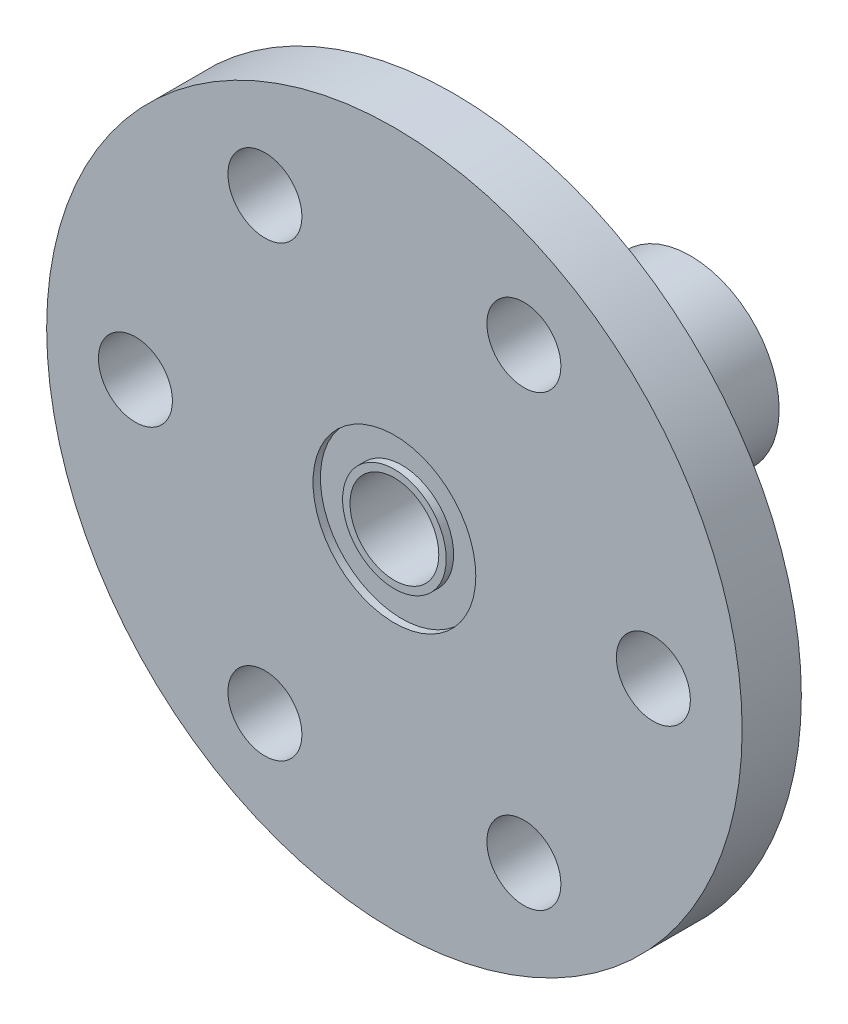
ISO-10303-21;
HEADER;
FILE_DESCRIPTION(('STEP AP214'),'2;1');
FILE_NAME('part.step','',(''),(''),'','','');
FILE_SCHEMA(('AUTOMOTIVE_DESIGN { 1 0 10303 214 1 1 1 1 }'));
ENDSEC;
DATA;
#1=APPLICATION_CONTEXT('core data for automotive mechanical design processes');
#2=APPLICATION_PROTOCOL_DEFINITION('international standard','automotive_design',2000,#1);
#3=PRODUCT_CONTEXT('',#1,'mechanical');
#4=PRODUCT('Part','Part','',(#3));
#5=PRODUCT_RELATED_PRODUCT_CATEGORY('part','',(#4));
#6=PRODUCT_DEFINITION_FORMATION('','',#4);
#7=PRODUCT_DEFINITION_CONTEXT('part definition',#1,'design');
#8=PRODUCT_DEFINITION('design','',#6,#7);
#9=PRODUCT_DEFINITION_SHAPE('','',#8);
#10=(LENGTH_UNIT() NAMED_UNIT(*) SI_UNIT(.MILLI.,.METRE.));
#11=(NAMED_UNIT(*) PLANE_ANGLE_UNIT() SI_UNIT($,.RADIAN.));
#12=(NAMED_UNIT(*) SI_UNIT($,.STERADIAN.) SOLID_ANGLE_UNIT());
#13=UNCERTAINTY_MEASURE_WITH_UNIT(LENGTH_MEASURE(1.E-05),#10,'distance_accuracy_value','');
#14=(GEOMETRIC_REPRESENTATION_CONTEXT(3) GLOBAL_UNCERTAINTY_ASSIGNED_CONTEXT((#13)) GLOBAL_UNIT_ASSIGNED_CONTEXT((#10,
#11,#12)) REPRESENTATION_CONTEXT('',''));
#15=CARTESIAN_POINT('',(0.,0.,0.));
#16=DIRECTION('',(0.,0.,1.));
#17=DIRECTION('',(1.,0.,0.));
#18=AXIS2_PLACEMENT_3D('',#15,#16,#17);
#19=CARTESIAN_POINT('',(0.,0.,4.));
#20=DIRECTION('',(0.,0.,-1.));
#21=DIRECTION('',(-1.,0.,0.));
#22=AXIS2_PLACEMENT_3D('',#19,#20,#21);
#23=CYLINDRICAL_SURFACE('',#22,3.);
#24=CARTESIAN_POINT('',(0.,-3.,-10.));
#25=CARTESIAN_POINT('',(0.100484716668078,-3.0000004164484,-10.0000005496325));
#26=CARTESIAN_POINT('',(0.200969087132901,-2.99490802753388,-9.9923860300445));
#27=CARTESIAN_POINT('',(0.398733058031681,-2.97504652423809,-9.96240313589434));
#28=CARTESIAN_POINT('',(0.496011113955007,-2.96027281581235,-9.94002775687671));
#29=CARTESIAN_POINT('',(0.684212307854249,-2.92250482404708,-9.88189228267516));
#30=CARTESIAN_POINT('',(0.775162872657554,-2.89954905493315,-9.84619485999206));
#31=CARTESIAN_POINT('',(0.94941529099726,-2.8472613787744,-9.7629366367285));
#32=CARTESIAN_POINT('',(1.03271603160967,-2.8179285460551,-9.71537411369944));
#33=CARTESIAN_POINT('',(1.19728470077011,-2.75227329369838,-9.60534306263257));
#34=CARTESIAN_POINT('',(1.27778030546067,-2.71556897579319,-9.54195213925711));
#35=CARTESIAN_POINT('',(1.42772804469274,-2.63982313083466,-9.40426995134155));
#36=CARTESIAN_POINT('',(1.49716405543888,-2.60077830356832,-9.32996307016226));
#37=CARTESIAN_POINT('',(1.63422297745496,-2.51728264678794,-9.15894763238733));
#38=CARTESIAN_POINT('',(1.6998318636275,-2.47295067937795,-9.06055434679655));
#39=CARTESIAN_POINT('',(1.81350357014175,-2.3908414735282,-8.85163662235347));
#40=CARTESIAN_POINT('',(1.86159673426503,-2.35305295954668,-8.74113359843726));
#41=CARTESIAN_POINT('',(1.92674035011438,-2.29976266641461,-8.54328870657837));
#42=CARTESIAN_POINT('',(1.94874447236008,-2.28097627892403,-8.45847154712609));
#43=CARTESIAN_POINT('',(1.98150617785228,-2.25257969659604,-8.28525549525835));
#44=CARTESIAN_POINT('',(1.99228314651963,-2.24295368744147,-8.19686305127394));
#45=CARTESIAN_POINT('',(2.00191364141227,-2.23436605608045,-8.01852522114353));
#46=CARTESIAN_POINT('',(2.00071842917524,-2.23544802558502,-7.9285749765476));
#47=CARTESIAN_POINT('',(1.98637581333356,-2.24819775483425,-7.75036502650024));
#48=CARTESIAN_POINT('',(1.97321828380393,-2.25987448286881,-7.66210681797187));
#49=CARTESIAN_POINT('',(1.93664994217326,-2.2912718598996,-7.49353294875812));
#50=CARTESIAN_POINT('',(1.91371711479477,-2.31061488324375,-7.41303866406123));
#51=CARTESIAN_POINT('',(1.85870118583424,-2.35509622933623,-7.25697630902422));
#52=CARTESIAN_POINT('',(1.8266150732855,-2.3802364585489,-7.18140986976135));
#53=CARTESIAN_POINT('',(1.74673818732648,-2.43964196377947,-7.02097460464356));
#54=CARTESIAN_POINT('',(1.69708052300445,-2.47472317740626,-6.9373400995169));
#55=CARTESIAN_POINT('',(1.58668960438221,-2.54691537733438,-6.77861660471425));
#56=CARTESIAN_POINT('',(1.52594268999614,-2.58402882709328,-6.70353834223793));
#57=CARTESIAN_POINT('',(1.37981165322308,-2.66543343763724,-6.54745745439658));
#58=CARTESIAN_POINT('',(1.29193938283656,-2.7095474472056,-6.46866595131724));
#59=CARTESIAN_POINT('',(1.10200799908008,-2.79218100665212,-6.32680350546151));
#60=CARTESIAN_POINT('',(0.999962299343694,-2.83070577648042,-6.26371785459102));
#61=CARTESIAN_POINT('',(0.804857827096527,-2.89145404090364,-6.16652228137713));
#62=CARTESIAN_POINT('',(0.713957643371907,-2.9153926116554,-6.12915663666106));
#63=CARTESIAN_POINT('',(0.526036043935477,-2.95507719030499,-6.06789507437463));
#64=CARTESIAN_POINT('',(0.429019879001647,-2.97083012127544,-6.04398777286778));
#65=CARTESIAN_POINT('',(0.230985453172278,-2.99275882156808,-6.010838834762));
#66=CARTESIAN_POINT('',(0.129951811934155,-2.99889322461187,-6.00166053906174));
#67=CARTESIAN_POINT('',(-0.0724415193893495,-3.00083114965147,-5.99875291143779));
#68=CARTESIAN_POINT('',(-0.173801186186628,-2.99663539385634,-6.00502249951123));
#69=CARTESIAN_POINT('',(-0.366455717204242,-2.97899589424273,-6.03162405556195));
#70=CARTESIAN_POINT('',(-0.457957444679196,-2.96622246390226,-6.05093729775522));
#71=CARTESIAN_POINT('',(-0.636116392427403,-2.93318449284837,-6.10159568601286));
#72=CARTESIAN_POINT('',(-0.722772837571136,-2.91291875746989,-6.13294275092821));
#73=CARTESIAN_POINT('',(-0.894664750465999,-2.86496352529158,-6.20865229704492));
#74=CARTESIAN_POINT('',(-0.979496184631422,-2.83689870135785,-6.25368815408186));
#75=CARTESIAN_POINT('',(-1.14068302395729,-2.7760185561151,-6.35443328994628));
#76=CARTESIAN_POINT('',(-1.21703314820091,-2.74320030403941,-6.41014916053217));
#77=CARTESIAN_POINT('',(-1.37185445482324,-2.6695454665343,-6.54060786815751));
#78=CARTESIAN_POINT('',(-1.44875187569565,-2.62826156800165,-6.61696626007509));
#79=CARTESIAN_POINT('',(-1.58933968069449,-2.54571173085957,-6.78111142995712));
#80=CARTESIAN_POINT('',(-1.6530209365723,-2.50444582417845,-6.86890603910751));
#81=CARTESIAN_POINT('',(-1.76124776549313,-2.4293967897058,-7.04714241276813));
#82=CARTESIAN_POINT('',(-1.80695636125283,-2.39527597025701,-7.13673203346221));
#83=CARTESIAN_POINT('',(-1.88496213740264,-2.33438974266154,-7.32387265244364));
#84=CARTESIAN_POINT('',(-1.91728345682189,-2.30761112529822,-7.42140893830463));
#85=CARTESIAN_POINT('',(-1.9623584346534,-2.26933208182633,-7.60456448719542));
#86=CARTESIAN_POINT('',(-1.97758597566225,-2.25594998021257,-7.68917180987601));
#87=CARTESIAN_POINT('',(-1.99699205923373,-2.23879466438398,-7.86057328131839));
#88=CARTESIAN_POINT('',(-2.00118260285317,-2.23501101347816,-7.9473649511395));
#89=CARTESIAN_POINT('',(-1.99823921981266,-2.23764201149981,-8.1206430567237));
#90=CARTESIAN_POINT('',(-1.99109858767783,-2.24406269907463,-8.20712928137376));
#91=CARTESIAN_POINT('',(-1.96596997224746,-2.26610452403491,-8.37734352853212));
#92=CARTESIAN_POINT('',(-1.94796751728258,-2.28173793527615,-8.46106771382433));
#93=CARTESIAN_POINT('',(-1.89593035657494,-2.32526843904801,-8.64571118648124));
#94=CARTESIAN_POINT('',(-1.85890187130765,-2.35532333574983,-8.74526771294333));
#95=CARTESIAN_POINT('',(-1.7708452623622,-2.42222161121309,-8.93548683438421));
#96=CARTESIAN_POINT('',(-1.71979748341259,-2.459074496867,-9.02613669799169));
#97=CARTESIAN_POINT('',(-1.60398280555153,-2.53617186577119,-9.19928188713623));
#98=CARTESIAN_POINT('',(-1.53898309894021,-2.5764658739228,-9.28159874542305));
#99=CARTESIAN_POINT('',(-1.39671768031094,-2.65628301537844,-9.43532247825793));
#100=CARTESIAN_POINT('',(-1.31944821025748,-2.69580590832396,-9.50672599702921));
#101=CARTESIAN_POINT('',(-1.14145732976974,-2.77631551964082,-9.64671210430908));
#102=CARTESIAN_POINT('',(-1.03896166955575,-2.81669805449991,-9.71341864017832));
#103=CARTESIAN_POINT('',(-0.820868555771217,-2.88777665874161,-9.8279132766653));
#104=CARTESIAN_POINT('',(-0.705292062449156,-2.91848793445255,-9.87573110682395));
#105=CARTESIAN_POINT('',(-0.491435069835745,-2.96101644836895,-9.94115457816378));
#106=CARTESIAN_POINT('',(-0.395012325257921,-2.97551480368935,-9.96311103909862));
#107=CARTESIAN_POINT('',(-0.199058012023946,-2.99500280141853,-9.9925280325381));
#108=CARTESIAN_POINT('',(-0.0995288361880077,-2.99999958751315,-9.99999945559601));
#109=CARTESIAN_POINT('',(0.,-3.,-10.));
#110=B_SPLINE_CURVE_WITH_KNOTS('',3,(#24,#25,#26,#27,#28,#29,#30,#31,#32,#33,#34,#35,#36,#37,
#38,#39,#40,#41,#42,#43,#44,#45,#46,#47,#48,#49,#50,#51,#52,#53,#54,#55,#56,#57,#58,#59,#60,#61,
#62,#63,#64,#65,#66,#67,#68,#69,#70,#71,#72,#73,#74,#75,#76,#77,#78,#79,#80,#81,#82,#83,#84,#85,
#86,#87,#88,#89,#90,#91,#92,#93,#94,#95,#96,#97,#98,#99,#100,#101,#102,#103,#104,#105,#106,#107,
#108,#109),.UNSPECIFIED.,.T.,.F.,(4,2,2,2,2,2,2,2,2,2,2,2,2,2,2,2,2,2,2,2,2,2,2,2,2,2,2,2,2,2,2,
2,2,2,2,2,2,2,2,2,2,2,4),(0.,0.3010532265054,0.602249414348688,0.902046153190231,
1.20188643867387,1.52717029000557,1.85292411604319,2.23006683295982,2.60655305445439,
2.87433693676029,3.14165767845809,3.41006711735378,3.67870397263352,3.93548862198022,
4.19235783805079,4.50147574660874,4.81097703780057,5.18718954496752,5.56304840301363,
5.86524087696758,6.16717735142814,6.47040883294251,6.77361911533415,7.05553084792473,
7.33748755138271,7.63652346829516,7.93574454945204,8.28228176141292,8.62905753175758,
8.94649935304476,9.26336626640723,9.52324048016135,9.78283200333091,10.0425772028455,
10.302669238524,10.6320660870419,10.9619271337795,11.2977924520448,11.6337608397015,
12.0179535155883,12.4015390656082,12.6999529136674,12.9981423125957),.UNSPECIFIED.);
#111=CARTESIAN_POINT('',(0.,-3.,-10.));
#112=VERTEX_POINT('',#111);
#113=EDGE_CURVE('E75',#112,#112,#110,.T.);
#114=ORIENTED_EDGE('',*,*,#113,.T.);
#115=EDGE_LOOP('',(#114));
#116=FACE_BOUND('',#115,.T.);
#117=CARTESIAN_POINT('',(0.,0.,4.));
#118=DIRECTION('',(0.,0.,1.));
#119=DIRECTION('',(1.,0.,0.));
#120=AXIS2_PLACEMENT_3D('',#117,#118,#119);
#121=CIRCLE('',#120,3.);
#122=CARTESIAN_POINT('',(3.,0.,4.));
#123=VERTEX_POINT('',#122);
#124=EDGE_CURVE('E130',#123,#123,#121,.T.);
#125=ORIENTED_EDGE('',*,*,#124,.T.);
#126=EDGE_LOOP('',(#125));
#127=FACE_BOUND('',#126,.T.);
#128=CARTESIAN_POINT('',(0.,0.,-16.));
#129=DIRECTION('',(0.,0.,-1.));
#130=DIRECTION('',(-1.,0.,0.));
#131=AXIS2_PLACEMENT_3D('',#128,#129,#130);
#132=CIRCLE('',#131,3.);
#133=CARTESIAN_POINT('',(-3.,0.,-16.));
#134=VERTEX_POINT('',#133);
#135=EDGE_CURVE('E137',#134,#134,#132,.T.);
#136=ORIENTED_EDGE('',*,*,#135,.T.);
#137=EDGE_LOOP('',(#136));
#138=FACE_BOUND('',#137,.T.);
#139=CARTESIAN_POINT('',(0.,3.,-10.));
#140=CARTESIAN_POINT('',(-0.100484716668078,3.0000004164484,-10.0000005496325));
#141=CARTESIAN_POINT('',(-0.200969087132901,2.99490802753388,-9.9923860300445));
#142=CARTESIAN_POINT('',(-0.398733058031681,2.97504652423809,-9.96240313589434));
#143=CARTESIAN_POINT('',(-0.496011113955007,2.96027281581235,-9.94002775687671));
#144=CARTESIAN_POINT('',(-0.684212307854249,2.92250482404708,-9.88189228267516));
#145=CARTESIAN_POINT('',(-0.775162872657554,2.89954905493315,-9.84619485999206));
#146=CARTESIAN_POINT('',(-0.94941529099726,2.8472613787744,-9.7629366367285));
#147=CARTESIAN_POINT('',(-1.03271603160967,2.8179285460551,-9.71537411369944));
#148=CARTESIAN_POINT('',(-1.19728470077011,2.75227329369838,-9.60534306263257));
#149=CARTESIAN_POINT('',(-1.27778030546067,2.71556897579319,-9.54195213925711));
#150=CARTESIAN_POINT('',(-1.42772804469274,2.63982313083466,-9.40426995134155));
#151=CARTESIAN_POINT('',(-1.49716405543888,2.60077830356832,-9.32996307016226));
#152=CARTESIAN_POINT('',(-1.63422297745496,2.51728264678794,-9.15894763238733));
#153=CARTESIAN_POINT('',(-1.6998318636275,2.47295067937795,-9.06055434679655));
#154=CARTESIAN_POINT('',(-1.81350357014175,2.3908414735282,-8.85163662235347));
#155=CARTESIAN_POINT('',(-1.86159673426503,2.35305295954668,-8.74113359843726));
#156=CARTESIAN_POINT('',(-1.92674035011438,2.29976266641461,-8.54328870657837));
#157=CARTESIAN_POINT('',(-1.94874447236008,2.28097627892403,-8.45847154712609));
#158=CARTESIAN_POINT('',(-1.98150617785228,2.25257969659604,-8.28525549525835));
#159=CARTESIAN_POINT('',(-1.99228314651963,2.24295368744147,-8.19686305127394));
#160=CARTESIAN_POINT('',(-2.00191364141227,2.23436605608045,-8.01852522114353));
#161=CARTESIAN_POINT('',(-2.00071842917524,2.23544802558502,-7.9285749765476));
#162=CARTESIAN_POINT('',(-1.98637581333356,2.24819775483425,-7.75036502650024));
#163=CARTESIAN_POINT('',(-1.97321828380393,2.25987448286881,-7.66210681797187));
#164=CARTESIAN_POINT('',(-1.93664994217326,2.2912718598996,-7.49353294875812));
#165=CARTESIAN_POINT('',(-1.91371711479477,2.31061488324375,-7.41303866406123));
#166=CARTESIAN_POINT('',(-1.85870118583424,2.35509622933623,-7.25697630902422));
#167=CARTESIAN_POINT('',(-1.8266150732855,2.3802364585489,-7.18140986976135));
#168=CARTESIAN_POINT('',(-1.74673818732648,2.43964196377947,-7.02097460464356));
#169=CARTESIAN_POINT('',(-1.69708052300445,2.47472317740626,-6.9373400995169));
#170=CARTESIAN_POINT('',(-1.58668960438221,2.54691537733438,-6.77861660471425));
#171=CARTESIAN_POINT('',(-1.52594268999614,2.58402882709328,-6.70353834223793));
#172=CARTESIAN_POINT('',(-1.37981165322308,2.66543343763724,-6.54745745439658));
#173=CARTESIAN_POINT('',(-1.29193938283656,2.7095474472056,-6.46866595131724));
#174=CARTESIAN_POINT('',(-1.10200799908008,2.79218100665212,-6.32680350546151));
#175=CARTESIAN_POINT('',(-0.999962299343694,2.83070577648042,-6.26371785459102));
#176=CARTESIAN_POINT('',(-0.804857827096527,2.89145404090364,-6.16652228137713));
#177=CARTESIAN_POINT('',(-0.713957643371907,2.9153926116554,-6.12915663666106));
#178=CARTESIAN_POINT('',(-0.526036043935477,2.95507719030499,-6.06789507437463));
#179=CARTESIAN_POINT('',(-0.429019879001647,2.97083012127544,-6.04398777286778));
#180=CARTESIAN_POINT('',(-0.230985453172278,2.99275882156808,-6.010838834762));
#181=CARTESIAN_POINT('',(-0.129951811934155,2.99889322461187,-6.00166053906174));
#182=CARTESIAN_POINT('',(0.0724415193893495,3.00083114965147,-5.99875291143779));
#183=CARTESIAN_POINT('',(0.173801186186628,2.99663539385634,-6.00502249951123));
#184=CARTESIAN_POINT('',(0.366455717204242,2.97899589424273,-6.03162405556195));
#185=CARTESIAN_POINT('',(0.457957444679196,2.96622246390226,-6.05093729775522));
#186=CARTESIAN_POINT('',(0.636116392427403,2.93318449284837,-6.10159568601286));
#187=CARTESIAN_POINT('',(0.722772837571136,2.91291875746989,-6.13294275092821));
#188=CARTESIAN_POINT('',(0.894664750465999,2.86496352529158,-6.20865229704492));
#189=CARTESIAN_POINT('',(0.979496184631422,2.83689870135785,-6.25368815408186));
#190=CARTESIAN_POINT('',(1.14068302395729,2.7760185561151,-6.35443328994628));
#191=CARTESIAN_POINT('',(1.21703314820091,2.74320030403941,-6.41014916053217));
#192=CARTESIAN_POINT('',(1.37185445482324,2.6695454665343,-6.54060786815751));
#193=CARTESIAN_POINT('',(1.44875187569565,2.62826156800165,-6.61696626007509));
#194=CARTESIAN_POINT('',(1.58933968069449,2.54571173085957,-6.78111142995712));
#195=CARTESIAN_POINT('',(1.6530209365723,2.50444582417845,-6.86890603910751));
#196=CARTESIAN_POINT('',(1.76124776549313,2.4293967897058,-7.04714241276813));
#197=CARTESIAN_POINT('',(1.80695636125283,2.39527597025701,-7.13673203346221));
#198=CARTESIAN_POINT('',(1.88496213740264,2.33438974266154,-7.32387265244364));
#199=CARTESIAN_POINT('',(1.91728345682189,2.30761112529822,-7.42140893830463));
#200=CARTESIAN_POINT('',(1.9623584346534,2.26933208182633,-7.60456448719542));
#201=CARTESIAN_POINT('',(1.97758597566225,2.25594998021257,-7.68917180987601));
#202=CARTESIAN_POINT('',(1.99699205923373,2.23879466438398,-7.86057328131839));
#203=CARTESIAN_POINT('',(2.00118260285317,2.23501101347816,-7.9473649511395));
#204=CARTESIAN_POINT('',(1.99823921981266,2.23764201149981,-8.1206430567237));
#205=CARTESIAN_POINT('',(1.99109858767783,2.24406269907463,-8.20712928137376));
#206=CARTESIAN_POINT('',(1.96596997224746,2.26610452403491,-8.37734352853212));
#207=CARTESIAN_POINT('',(1.94796751728258,2.28173793527615,-8.46106771382433));
#208=CARTESIAN_POINT('',(1.89593035657494,2.32526843904801,-8.64571118648124));
#209=CARTESIAN_POINT('',(1.85890187130765,2.35532333574983,-8.74526771294333));
#210=CARTESIAN_POINT('',(1.7708452623622,2.42222161121309,-8.93548683438421));
#211=CARTESIAN_POINT('',(1.71979748341259,2.459074496867,-9.02613669799169));
#212=CARTESIAN_POINT('',(1.60398280555153,2.53617186577119,-9.19928188713623));
#213=CARTESIAN_POINT('',(1.53898309894021,2.5764658739228,-9.28159874542305));
#214=CARTESIAN_POINT('',(1.39671768031094,2.65628301537844,-9.43532247825793));
#215=CARTESIAN_POINT('',(1.31944821025748,2.69580590832396,-9.50672599702921));
#216=CARTESIAN_POINT('',(1.14145732976974,2.77631551964082,-9.64671210430908));
#217=CARTESIAN_POINT('',(1.03896166955575,2.81669805449991,-9.71341864017832));
#218=CARTESIAN_POINT('',(0.820868555771217,2.88777665874161,-9.8279132766653));
#219=CARTESIAN_POINT('',(0.705292062449156,2.91848793445255,-9.87573110682395));
#220=CARTESIAN_POINT('',(0.491435069835745,2.96101644836895,-9.94115457816378));
#221=CARTESIAN_POINT('',(0.395012325257921,2.97551480368935,-9.96311103909862));
#222=CARTESIAN_POINT('',(0.199058012023946,2.99500280141853,-9.9925280325381));
#223=CARTESIAN_POINT('',(0.0995288361880077,2.99999958751315,-9.99999945559601));
#224=CARTESIAN_POINT('',(0.,3.,-10.));
#225=B_SPLINE_CURVE_WITH_KNOTS('',3,(#139,#140,#141,#142,#143,#144,#145,#146,#147,#148,#149,
#150,#151,#152,#153,#154,#155,#156,#157,#158,#159,#160,#161,#162,#163,#164,#165,#166,#167,#168,
#169,#170,#171,#172,#173,#174,#175,#176,#177,#178,#179,#180,#181,#182,#183,#184,#185,#186,#187,
#188,#189,#190,#191,#192,#193,#194,#195,#196,#197,#198,#199,#200,#201,#202,#203,#204,#205,#206,
#207,#208,#209,#210,#211,#212,#213,#214,#215,#216,#217,#218,#219,#220,#221,#222,#223,#224),
.UNSPECIFIED.,.T.,.F.,(4,2,2,2,2,2,2,2,2,2,2,2,2,2,2,2,2,2,2,2,2,2,2,2,2,2,2,2,2,2,2,2,2,2,2,2,
2,2,2,2,2,2,4),(0.,0.3010532265054,0.602249414348688,0.902046153190231,1.20188643867387,
1.52717029000557,1.85292411604319,2.23006683295982,2.60655305445439,2.87433693676029,
3.14165767845809,3.41006711735378,3.67870397263352,3.93548862198022,4.19235783805079,
4.50147574660874,4.81097703780057,5.18718954496752,5.56304840301363,5.86524087696758,
6.16717735142814,6.47040883294251,6.77361911533415,7.05553084792473,7.33748755138271,
7.63652346829516,7.93574454945204,8.28228176141292,8.62905753175758,8.94649935304476,
9.26336626640723,9.52324048016135,9.78283200333091,10.0425772028455,10.302669238524,
10.6320660870419,10.9619271337795,11.2977924520448,11.6337608397015,12.0179535155883,
12.4015390656082,12.6999529136674,12.9981423125957),.UNSPECIFIED.);
#226=CARTESIAN_POINT('',(0.,3.,-10.));
#227=VERTEX_POINT('',#226);
#228=EDGE_CURVE('E80',#227,#227,#225,.T.);
#229=ORIENTED_EDGE('',*,*,#228,.T.);
#230=EDGE_LOOP('',(#229));
#231=FACE_BOUND('',#230,.T.);
#232=ADVANCED_FACE('F32',(#116,#127,#138,#231),#23,.F.);
#233=CARTESIAN_POINT('',(0.,0.,-16.));
#234=DIRECTION('',(0.,0.,1.));
#235=DIRECTION('',(1.,0.,0.));
#236=AXIS2_PLACEMENT_3D('',#233,#234,#235);
#237=CYLINDRICAL_SURFACE('',#236,6.);
#238=CARTESIAN_POINT('',(0.,0.,-16.));
#239=DIRECTION('',(0.,0.,-1.));
#240=DIRECTION('',(-1.,0.,0.));
#241=AXIS2_PLACEMENT_3D('',#238,#239,#240);
#242=CIRCLE('',#241,6.);
#243=CARTESIAN_POINT('',(-6.,0.,-16.));
#244=VERTEX_POINT('',#243);
#245=EDGE_CURVE('E132',#244,#244,#242,.T.);
#246=ORIENTED_EDGE('',*,*,#245,.F.);
#247=EDGE_LOOP('',(#246));
#248=FACE_BOUND('',#247,.T.);
#249=CARTESIAN_POINT('',(0.,0.,0.));
#250=DIRECTION('',(0.,0.,1.));
#251=DIRECTION('',(1.,0.,0.));
#252=AXIS2_PLACEMENT_3D('',#249,#250,#251);
#253=CIRCLE('',#252,6.);
#254=CARTESIAN_POINT('',(6.,0.,0.));
#255=VERTEX_POINT('',#254);
#256=EDGE_CURVE('E10',#255,#255,#253,.F.);
#257=ORIENTED_EDGE('',*,*,#256,.T.);
#258=EDGE_LOOP('',(#257));
#259=FACE_BOUND('',#258,.T.);
#260=CARTESIAN_POINT('',(0.,-6.,-10.));
#261=CARTESIAN_POINT('',(0.109126725773446,-6.00000030601888,-10.0000005074633));
#262=CARTESIAN_POINT('',(0.2182503890771,-5.9969953901509,-9.99103946774557));
#263=CARTESIAN_POINT('',(0.433283521745945,-5.98530420406562,-9.95554178236556));
#264=CARTESIAN_POINT('',(0.539192656237636,-5.97661734404305,-9.92900331210216));
#265=CARTESIAN_POINT('',(0.744665579003552,-5.95450615812885,-9.8593615132319));
#266=CARTESIAN_POINT('',(0.844239651772068,-5.94108975461707,-9.81628587508146));
#267=CARTESIAN_POINT('',(1.03474987361065,-5.91088891434684,-9.71491765432331));
#268=CARTESIAN_POINT('',(1.12568431391741,-5.89410381335556,-9.6566220699948));
#269=CARTESIAN_POINT('',(1.29948335004453,-5.8582818888601,-9.52434839028249));
#270=CARTESIAN_POINT('',(1.38200740059662,-5.8391911292757,-9.44993753147901));
#271=CARTESIAN_POINT('',(1.53366538540417,-5.80120629566243,-9.28846569058687));
#272=CARTESIAN_POINT('',(1.60279637097892,-5.78231226581098,-9.20140193014298));
#273=CARTESIAN_POINT('',(1.72764988445572,-5.74626664954548,-9.01402976960708));
#274=CARTESIAN_POINT('',(1.78292971644206,-5.72918078551376,-8.91341252053576));
#275=CARTESIAN_POINT('',(1.87563774775544,-5.69950610837202,-8.70364781108291));
#276=CARTESIAN_POINT('',(1.91307139477353,-5.68691592321491,-8.59450296567451));
#277=CARTESIAN_POINT('',(1.96774692301833,-5.66822606538755,-8.37465355700658));
#278=CARTESIAN_POINT('',(1.98562689654354,-5.66192191539223,-8.26412558302187));
#279=CARTESIAN_POINT('',(2.00268224666895,-5.65591313259015,-8.04147249168824));
#280=CARTESIAN_POINT('',(2.00186340320944,-5.6562064604546,-7.92934787858162));
#281=CARTESIAN_POINT('',(1.98203980740684,-5.6631803001636,-7.71212673911196));
#282=CARTESIAN_POINT('',(1.96386782633399,-5.66956831735066,-7.60694319416196));
#283=CARTESIAN_POINT('',(1.91121232569883,-5.68753315449102,-7.40121316078633));
#284=CARTESIAN_POINT('',(1.87672685318374,-5.69911059568215,-7.30066722912986));
#285=CARTESIAN_POINT('',(1.79187811612042,-5.72635822262498,-7.10517450081704));
#286=CARTESIAN_POINT('',(1.74126809741453,-5.74209131586235,-7.01034394906095));
#287=CARTESIAN_POINT('',(1.62577821260628,-5.77585117151453,-6.83025818344055));
#288=CARTESIAN_POINT('',(1.56089422472801,-5.79387859580927,-6.74500574613324));
#289=CARTESIAN_POINT('',(1.41469866536448,-5.83134658335482,-6.58181680367846));
#290=CARTESIAN_POINT('',(1.33270630015262,-5.85081178709686,-6.50449461098186));
#291=CARTESIAN_POINT('',(1.15667913994013,-5.88813876774073,-6.36453746667321));
#292=CARTESIAN_POINT('',(1.06264319132163,-5.90600039076135,-6.30190392367101));
#293=CARTESIAN_POINT('',(0.863895226092536,-5.93834215875587,-6.19260739952986));
#294=CARTESIAN_POINT('',(0.759086552832674,-5.95278700016078,-6.14610901731854));
#295=CARTESIAN_POINT('',(0.542538166729016,-5.9764113428887,-6.07159365208858));
#296=CARTESIAN_POINT('',(0.430800876309908,-5.98559267309759,-6.04357024915312));
#297=CARTESIAN_POINT('',(0.208767659058609,-5.99735254142881,-6.00788866795528));
#298=CARTESIAN_POINT('',(0.0986191997296935,-6.00020003667456,-5.9994003816545));
#299=CARTESIAN_POINT('',(-0.121550139920474,-5.99977805389655,-6.00066534719694));
#300=CARTESIAN_POINT('',(-0.2315710386393,-5.99650960838725,-6.01041551995975));
#301=CARTESIAN_POINT('',(-0.44503973260851,-5.98440049434209,-6.04722381547192));
#302=CARTESIAN_POINT('',(-0.548585613669686,-5.97572397422385,-6.07377241209899));
#303=CARTESIAN_POINT('',(-0.749711917159146,-5.9538369366014,-6.14278688893346));
#304=CARTESIAN_POINT('',(-0.847291577017212,-5.9406258409335,-6.18525479893557));
#305=CARTESIAN_POINT('',(-1.03657659278655,-5.9105786257458,-6.28614086368157));
#306=CARTESIAN_POINT('',(-1.12805991843429,-5.89365629511572,-6.34494918656634));
#307=CARTESIAN_POINT('',(-1.30012966027117,-5.85810507832525,-6.47638830002697));
#308=CARTESIAN_POINT('',(-1.38071273559115,-5.83947567187655,-6.54902331206353));
#309=CARTESIAN_POINT('',(-1.5325050156126,-5.8015369596089,-6.70995750201318));
#310=CARTESIAN_POINT('',(-1.60312193849154,-5.78223522174856,-6.79881845385372));
#311=CARTESIAN_POINT('',(-1.72851504464715,-5.74599946589417,-6.98754313562177));
#312=CARTESIAN_POINT('',(-1.78329109586203,-5.72906546764005,-7.08740695726815));
#313=CARTESIAN_POINT('',(-1.87519386083272,-5.69964783582767,-7.29534603057979));
#314=CARTESIAN_POINT('',(-1.91235626433004,-5.68715521585958,-7.40340415833753));
#315=CARTESIAN_POINT('',(-1.96778933351871,-5.66821664612899,-7.62475730008826));
#316=CARTESIAN_POINT('',(-1.98606850990788,-5.66176797247279,-7.7380499308087));
#317=CARTESIAN_POINT('',(-2.00255256495468,-5.65595717748355,-7.96039419208183));
#318=CARTESIAN_POINT('',(-2.0017405146168,-5.6562480051483,-8.06936468057365));
#319=CARTESIAN_POINT('',(-1.98248458689739,-5.66302539647735,-8.28553014984412));
#320=CARTESIAN_POINT('',(-1.96404175891717,-5.66951159138723,-8.39272523591018));
#321=CARTESIAN_POINT('',(-1.91074362625869,-5.68769048609783,-8.60027132600495));
#322=CARTESIAN_POINT('',(-1.87620669203103,-5.69928196044955,-8.70071365000899));
#323=CARTESIAN_POINT('',(-1.79195873151949,-5.72632797636937,-8.89445481387654));
#324=CARTESIAN_POINT('',(-1.74224433710761,-5.74178337526786,-8.98775206237601));
#325=CARTESIAN_POINT('',(-1.62652138516686,-5.77565658452093,-9.16896733984582));
#326=CARTESIAN_POINT('',(-1.55989648552916,-5.79417423284274,-9.25647300379677));
#327=CARTESIAN_POINT('',(-1.4132857662713,-5.83166712566506,-9.4193796267684));
#328=CARTESIAN_POINT('',(-1.33329616890296,-5.85064249824745,-9.49477715137615));
#329=CARTESIAN_POINT('',(-1.15848311384138,-5.88780061051088,-9.63428882457836));
#330=CARTESIAN_POINT('',(-1.06320302699946,-5.90592363602513,-9.697848695502));
#331=CARTESIAN_POINT('',(-0.86271471481325,-5.93851982345224,-9.80798085770129));
#332=CARTESIAN_POINT('',(-0.757509036264698,-5.9529939181586,-9.85455749184409));
#333=CARTESIAN_POINT('',(-0.544987294401953,-5.97611030137084,-9.92744326497734));
#334=CARTESIAN_POINT('',(-0.437975515352818,-5.98498424845045,-9.95456493252675));
#335=CARTESIAN_POINT('',(-0.220640832020495,-5.99692814128444,-9.99084056135425));
#336=CARTESIAN_POINT('',(-0.110318851137493,-5.9999996906381,-9.99999948699307));
#337=CARTESIAN_POINT('',(0.,-6.,-10.));
#338=B_SPLINE_CURVE_WITH_KNOTS('',3,(#260,#261,#262,#263,#264,#265,#266,#267,#268,#269,#270,
#271,#272,#273,#274,#275,#276,#277,#278,#279,#280,#281,#282,#283,#284,#285,#286,#287,#288,#289,
#290,#291,#292,#293,#294,#295,#296,#297,#298,#299,#300,#301,#302,#303,#304,#305,#306,#307,#308,
#309,#310,#311,#312,#313,#314,#315,#316,#317,#318,#319,#320,#321,#322,#323,#324,#325,#326,#327,
#328,#329,#330,#331,#332,#333,#334,#335,#336,#337),.UNSPECIFIED.,.T.,.F.,(4,2,2,2,2,2,2,2,2,2,2,
2,2,2,2,2,2,2,2,2,2,2,2,2,2,2,2,2,2,2,2,2,2,2,2,2,2,2,4),(0.,0.326974212052022,
0.653982370535041,0.980445345740548,1.3069727555982,1.64369368565512,1.9804886657506,
2.32696769646941,2.67334089385667,3.0080385148368,3.34263267974971,3.6619365310256,
3.98127861710964,4.30576342310261,4.63034205116414,4.97186611622734,5.31342291933236,
5.65836811300715,6.00319337754416,6.33307166350339,6.66289426328353,6.98316315956427,
7.30347290568207,7.63220799687473,7.96104361643782,8.30482045761504,8.64860016469993,
8.99168027653541,9.3346056941168,9.65991332128517,9.9852015870275,10.3043117416084,
10.6234927635196,10.9566013338361,11.2898042224756,11.635993216702,11.9820936230491,
12.3127311674763,12.6432773207628),.UNSPECIFIED.);
#339=CARTESIAN_POINT('',(0.,-6.,-10.));
#340=VERTEX_POINT('',#339);
#341=EDGE_CURVE('E53',#340,#340,#338,.T.);
#342=ORIENTED_EDGE('',*,*,#341,.F.);
#343=EDGE_LOOP('',(#342));
#344=FACE_BOUND('',#343,.T.);
#345=CARTESIAN_POINT('',(0.,6.,-10.));
#346=CARTESIAN_POINT('',(-0.109126725773446,6.00000030601888,-10.0000005074633));
#347=CARTESIAN_POINT('',(-0.2182503890771,5.9969953901509,-9.99103946774557));
#348=CARTESIAN_POINT('',(-0.433283521745945,5.98530420406562,-9.95554178236556));
#349=CARTESIAN_POINT('',(-0.539192656237636,5.97661734404305,-9.92900331210216));
#350=CARTESIAN_POINT('',(-0.744665579003552,5.95450615812885,-9.8593615132319));
#351=CARTESIAN_POINT('',(-0.844239651772068,5.94108975461707,-9.81628587508146));
#352=CARTESIAN_POINT('',(-1.03474987361065,5.91088891434684,-9.71491765432331));
#353=CARTESIAN_POINT('',(-1.12568431391741,5.89410381335556,-9.6566220699948));
#354=CARTESIAN_POINT('',(-1.29948335004453,5.8582818888601,-9.52434839028249));
#355=CARTESIAN_POINT('',(-1.38200740059662,5.8391911292757,-9.44993753147901));
#356=CARTESIAN_POINT('',(-1.53366538540417,5.80120629566243,-9.28846569058687));
#357=CARTESIAN_POINT('',(-1.60279637097892,5.78231226581098,-9.20140193014298));
#358=CARTESIAN_POINT('',(-1.72764988445572,5.74626664954548,-9.01402976960708));
#359=CARTESIAN_POINT('',(-1.78292971644206,5.72918078551376,-8.91341252053576));
#360=CARTESIAN_POINT('',(-1.87563774775544,5.69950610837202,-8.70364781108291));
#361=CARTESIAN_POINT('',(-1.91307139477353,5.68691592321491,-8.59450296567451));
#362=CARTESIAN_POINT('',(-1.96774692301833,5.66822606538755,-8.37465355700658));
#363=CARTESIAN_POINT('',(-1.98562689654354,5.66192191539223,-8.26412558302187));
#364=CARTESIAN_POINT('',(-2.00268224666895,5.65591313259015,-8.04147249168824));
#365=CARTESIAN_POINT('',(-2.00186340320944,5.6562064604546,-7.92934787858162));
#366=CARTESIAN_POINT('',(-1.98203980740684,5.6631803001636,-7.71212673911196));
#367=CARTESIAN_POINT('',(-1.96386782633399,5.66956831735066,-7.60694319416196));
#368=CARTESIAN_POINT('',(-1.91121232569883,5.68753315449102,-7.40121316078633));
#369=CARTESIAN_POINT('',(-1.87672685318374,5.69911059568215,-7.30066722912986));
#370=CARTESIAN_POINT('',(-1.79187811612042,5.72635822262498,-7.10517450081704));
#371=CARTESIAN_POINT('',(-1.74126809741453,5.74209131586235,-7.01034394906095));
#372=CARTESIAN_POINT('',(-1.62577821260628,5.77585117151453,-6.83025818344055));
#373=CARTESIAN_POINT('',(-1.56089422472801,5.79387859580927,-6.74500574613324));
#374=CARTESIAN_POINT('',(-1.41469866536448,5.83134658335482,-6.58181680367846));
#375=CARTESIAN_POINT('',(-1.33270630015262,5.85081178709686,-6.50449461098186));
#376=CARTESIAN_POINT('',(-1.15667913994013,5.88813876774073,-6.36453746667321));
#377=CARTESIAN_POINT('',(-1.06264319132163,5.90600039076135,-6.30190392367101));
#378=CARTESIAN_POINT('',(-0.863895226092536,5.93834215875587,-6.19260739952986));
#379=CARTESIAN_POINT('',(-0.759086552832674,5.95278700016078,-6.14610901731854));
#380=CARTESIAN_POINT('',(-0.542538166729016,5.9764113428887,-6.07159365208858));
#381=CARTESIAN_POINT('',(-0.430800876309908,5.98559267309759,-6.04357024915312));
#382=CARTESIAN_POINT('',(-0.208767659058609,5.99735254142881,-6.00788866795528));
#383=CARTESIAN_POINT('',(-0.0986191997296935,6.00020003667456,-5.9994003816545));
#384=CARTESIAN_POINT('',(0.121550139920474,5.99977805389655,-6.00066534719694));
#385=CARTESIAN_POINT('',(0.2315710386393,5.99650960838725,-6.01041551995975));
#386=CARTESIAN_POINT('',(0.44503973260851,5.98440049434209,-6.04722381547192));
#387=CARTESIAN_POINT('',(0.548585613669686,5.97572397422385,-6.07377241209899));
#388=CARTESIAN_POINT('',(0.749711917159146,5.9538369366014,-6.14278688893346));
#389=CARTESIAN_POINT('',(0.847291577017212,5.9406258409335,-6.18525479893557));
#390=CARTESIAN_POINT('',(1.03657659278655,5.9105786257458,-6.28614086368157));
#391=CARTESIAN_POINT('',(1.12805991843429,5.89365629511572,-6.34494918656634));
#392=CARTESIAN_POINT('',(1.30012966027117,5.85810507832525,-6.47638830002697));
#393=CARTESIAN_POINT('',(1.38071273559115,5.83947567187655,-6.54902331206353));
#394=CARTESIAN_POINT('',(1.5325050156126,5.8015369596089,-6.70995750201318));
#395=CARTESIAN_POINT('',(1.60312193849154,5.78223522174856,-6.79881845385372));
#396=CARTESIAN_POINT('',(1.72851504464715,5.74599946589417,-6.98754313562177));
#397=CARTESIAN_POINT('',(1.78329109586203,5.72906546764005,-7.08740695726815));
#398=CARTESIAN_POINT('',(1.87519386083272,5.69964783582767,-7.29534603057979));
#399=CARTESIAN_POINT('',(1.91235626433004,5.68715521585958,-7.40340415833753));
#400=CARTESIAN_POINT('',(1.96778933351871,5.66821664612899,-7.62475730008826));
#401=CARTESIAN_POINT('',(1.98606850990788,5.66176797247279,-7.7380499308087));
#402=CARTESIAN_POINT('',(2.00255256495468,5.65595717748355,-7.96039419208183));
#403=CARTESIAN_POINT('',(2.0017405146168,5.6562480051483,-8.06936468057365));
#404=CARTESIAN_POINT('',(1.98248458689739,5.66302539647735,-8.28553014984412));
#405=CARTESIAN_POINT('',(1.96404175891717,5.66951159138723,-8.39272523591018));
#406=CARTESIAN_POINT('',(1.91074362625869,5.68769048609783,-8.60027132600495));
#407=CARTESIAN_POINT('',(1.87620669203103,5.69928196044955,-8.70071365000899));
#408=CARTESIAN_POINT('',(1.79195873151949,5.72632797636937,-8.89445481387654));
#409=CARTESIAN_POINT('',(1.74224433710761,5.74178337526786,-8.98775206237601));
#410=CARTESIAN_POINT('',(1.62652138516686,5.77565658452093,-9.16896733984582));
#411=CARTESIAN_POINT('',(1.55989648552916,5.79417423284274,-9.25647300379677));
#412=CARTESIAN_POINT('',(1.4132857662713,5.83166712566506,-9.4193796267684));
#413=CARTESIAN_POINT('',(1.33329616890296,5.85064249824745,-9.49477715137615));
#414=CARTESIAN_POINT('',(1.15848311384138,5.88780061051088,-9.63428882457836));
#415=CARTESIAN_POINT('',(1.06320302699946,5.90592363602513,-9.697848695502));
#416=CARTESIAN_POINT('',(0.86271471481325,5.93851982345224,-9.80798085770129));
#417=CARTESIAN_POINT('',(0.757509036264698,5.9529939181586,-9.85455749184409));
#418=CARTESIAN_POINT('',(0.544987294401953,5.97611030137084,-9.92744326497734));
#419=CARTESIAN_POINT('',(0.437975515352818,5.98498424845045,-9.95456493252675));
#420=CARTESIAN_POINT('',(0.220640832020495,5.99692814128444,-9.99084056135425));
#421=CARTESIAN_POINT('',(0.110318851137493,5.9999996906381,-9.99999948699307));
#422=CARTESIAN_POINT('',(0.,6.,-10.));
#423=B_SPLINE_CURVE_WITH_KNOTS('',3,(#345,#346,#347,#348,#349,#350,#351,#352,#353,#354,#355,
#356,#357,#358,#359,#360,#361,#362,#363,#364,#365,#366,#367,#368,#369,#370,#371,#372,#373,#374,
#375,#376,#377,#378,#379,#380,#381,#382,#383,#384,#385,#386,#387,#388,#389,#390,#391,#392,#393,
#394,#395,#396,#397,#398,#399,#400,#401,#402,#403,#404,#405,#406,#407,#408,#409,#410,#411,#412,
#413,#414,#415,#416,#417,#418,#419,#420,#421,#422),.UNSPECIFIED.,.T.,.F.,(4,2,2,2,2,2,2,2,2,2,2,
2,2,2,2,2,2,2,2,2,2,2,2,2,2,2,2,2,2,2,2,2,2,2,2,2,2,2,4),(0.,0.326974212052022,
0.653982370535041,0.980445345740548,1.3069727555982,1.64369368565512,1.9804886657506,
2.32696769646941,2.67334089385667,3.0080385148368,3.34263267974971,3.6619365310256,
3.98127861710964,4.30576342310261,4.63034205116414,4.97186611622734,5.31342291933236,
5.65836811300715,6.00319337754416,6.33307166350339,6.66289426328353,6.98316315956427,
7.30347290568207,7.63220799687473,7.96104361643782,8.30482045761504,8.64860016469993,
8.99168027653541,9.3346056941168,9.65991332128517,9.9852015870275,10.3043117416084,
10.6234927635196,10.9566013338361,11.2898042224756,11.635993216702,11.9820936230491,
12.3127311674763,12.6432773207628),.UNSPECIFIED.);
#424=CARTESIAN_POINT('',(0.,6.,-10.));
#425=VERTEX_POINT('',#424);
#426=EDGE_CURVE('E36',#425,#425,#423,.T.);
#427=ORIENTED_EDGE('',*,*,#426,.F.);
#428=EDGE_LOOP('',(#427));
#429=FACE_BOUND('',#428,.T.);
#430=ADVANCED_FACE('F58',(#248,#259,#344,#429),#237,.T.);
#431=CARTESIAN_POINT('',(0.,0.,-16.));
#432=DIRECTION('',(0.,0.,-1.));
#433=DIRECTION('',(-1.,0.,0.));
#434=AXIS2_PLACEMENT_3D('',#431,#432,#433);
#435=PLANE('',#434);
#436=ORIENTED_EDGE('',*,*,#135,.F.);
#437=EDGE_LOOP('',(#436));
#438=FACE_BOUND('',#437,.T.);
#439=CARTESIAN_POINT('',(0.,0.,-16.));
#440=DIRECTION('',(0.,0.,-1.));
#441=DIRECTION('',(-1.,0.,0.));
#442=AXIS2_PLACEMENT_3D('',#439,#440,#441);
#443=CIRCLE('',#442,3.5);
#444=CARTESIAN_POINT('',(-3.5,0.,-16.));
#445=VERTEX_POINT('',#444);
#446=EDGE_CURVE('E185',#445,#445,#443,.T.);
#447=ORIENTED_EDGE('',*,*,#446,.T.);
#448=EDGE_LOOP('',(#447));
#449=FACE_BOUND('',#448,.T.);
#450=ADVANCED_FACE('F100',(#438,#449),#435,.T.);
#451=CARTESIAN_POINT('',(0.,0.,4.));
#452=DIRECTION('',(0.,0.,1.));
#453=DIRECTION('',(1.,0.,0.));
#454=AXIS2_PLACEMENT_3D('',#451,#452,#453);
#455=PLANE('',#454);
#456=ORIENTED_EDGE('',*,*,#124,.F.);
#457=EDGE_LOOP('',(#456));
#458=FACE_BOUND('',#457,.T.);
#459=CARTESIAN_POINT('',(0.,0.,4.));
#460=DIRECTION('',(0.,0.,1.));
#461=DIRECTION('',(1.,0.,0.));
#462=AXIS2_PLACEMENT_3D('',#459,#460,#461);
#463=CIRCLE('',#462,3.5);
#464=CARTESIAN_POINT('',(3.5,0.,4.));
#465=VERTEX_POINT('',#464);
#466=EDGE_CURVE('E173',#465,#465,#463,.T.);
#467=ORIENTED_EDGE('',*,*,#466,.T.);
#468=EDGE_LOOP('',(#467));
#469=FACE_BOUND('',#468,.T.);
#470=ADVANCED_FACE('F94',(#458,#469),#455,.T.);
#471=CARTESIAN_POINT('',(0.,0.,0.));
#472=DIRECTION('',(0.,0.,1.));
#473=DIRECTION('',(1.,0.,0.));
#474=AXIS2_PLACEMENT_3D('',#471,#472,#473);
#475=PLANE('',#474);
#476=CARTESIAN_POINT('',(-8.74999999999997,15.1554445662277,0.));
#477=DIRECTION('',(0.,0.,1.));
#478=DIRECTION('',(1.,0.,0.));
#479=AXIS2_PLACEMENT_3D('',#476,#477,#478);
#480=CIRCLE('',#479,2.5);
#481=CARTESIAN_POINT('',(-6.24999999999997,15.1554445662277,0.));
#482=VERTEX_POINT('',#481);
#483=EDGE_CURVE('E105',#482,#482,#480,.T.);
#484=ORIENTED_EDGE('',*,*,#483,.T.);
#485=EDGE_LOOP('',(#484));
#486=FACE_BOUND('',#485,.T.);
#487=CARTESIAN_POINT('',(8.75000000000007,15.1554445662276,0.));
#488=DIRECTION('',(0.,0.,1.));
#489=DIRECTION('',(1.,0.,0.));
#490=AXIS2_PLACEMENT_3D('',#487,#488,#489);
#491=CIRCLE('',#490,2.5);
#492=CARTESIAN_POINT('',(11.2500000000001,15.1554445662276,0.));
#493=VERTEX_POINT('',#492);
#494=EDGE_CURVE('E109',#493,#493,#491,.T.);
#495=ORIENTED_EDGE('',*,*,#494,.T.);
#496=EDGE_LOOP('',(#495));
#497=FACE_BOUND('',#496,.T.);
#498=CARTESIAN_POINT('',(17.5,-1.2220184685951E-13,0.));
#499=DIRECTION('',(0.,0.,1.));
#500=DIRECTION('',(1.,0.,0.));
#501=AXIS2_PLACEMENT_3D('',#498,#499,#500);
#502=CIRCLE('',#501,2.5);
#503=CARTESIAN_POINT('',(20.,-1.2220184685951E-13,0.));
#504=VERTEX_POINT('',#503);
#505=EDGE_CURVE('E113',#504,#504,#502,.T.);
#506=ORIENTED_EDGE('',*,*,#505,.T.);
#507=EDGE_LOOP('',(#506));
#508=FACE_BOUND('',#507,.T.);
#509=CARTESIAN_POINT('',(8.74999999999986,-15.1554445662278,0.));
#510=DIRECTION('',(0.,0.,1.));
#511=DIRECTION('',(1.,0.,0.));
#512=AXIS2_PLACEMENT_3D('',#509,#510,#511);
#513=CIRCLE('',#512,2.5);
#514=CARTESIAN_POINT('',(11.2499999999999,-15.1554445662278,0.));
#515=VERTEX_POINT('',#514);
#516=EDGE_CURVE('E117',#515,#515,#513,.T.);
#517=ORIENTED_EDGE('',*,*,#516,.T.);
#518=EDGE_LOOP('',(#517));
#519=FACE_BOUND('',#518,.T.);
#520=CARTESIAN_POINT('',(-8.75000000000018,-15.1554445662276,0.));
#521=DIRECTION('',(0.,0.,1.));
#522=DIRECTION('',(1.,0.,0.));
#523=AXIS2_PLACEMENT_3D('',#520,#521,#522);
#524=CIRCLE('',#523,2.5);
#525=CARTESIAN_POINT('',(-6.25000000000018,-15.1554445662276,0.));
#526=VERTEX_POINT('',#525);
#527=EDGE_CURVE('E121',#526,#526,#524,.T.);
#528=ORIENTED_EDGE('',*,*,#527,.T.);
#529=EDGE_LOOP('',(#528));
#530=FACE_BOUND('',#529,.T.);
#531=CARTESIAN_POINT('',(-17.5,0.,0.));
#532=DIRECTION('',(0.,0.,1.));
#533=DIRECTION('',(1.,0.,0.));
#534=AXIS2_PLACEMENT_3D('',#531,#532,#533);
#535=CIRCLE('',#534,2.5);
#536=CARTESIAN_POINT('',(-15.,0.,0.));
#537=VERTEX_POINT('',#536);
#538=EDGE_CURVE('E125',#537,#537,#535,.T.);
#539=ORIENTED_EDGE('',*,*,#538,.T.);
#540=EDGE_LOOP('',(#539));
#541=FACE_BOUND('',#540,.T.);
#542=CARTESIAN_POINT('',(0.,0.,0.));
#543=DIRECTION('',(0.,0.,1.));
#544=DIRECTION('',(1.,0.,0.));
#545=AXIS2_PLACEMENT_3D('',#542,#543,#544);
#546=CIRCLE('',#545,23.5);
#547=CARTESIAN_POINT('',(23.5,0.,0.));
#548=VERTEX_POINT('',#547);
#549=EDGE_CURVE('E50',#548,#548,#546,.T.);
#550=ORIENTED_EDGE('',*,*,#549,.F.);
#551=EDGE_LOOP('',(#550));
#552=FACE_BOUND('',#551,.T.);
#553=ORIENTED_EDGE('',*,*,#256,.F.);
#554=EDGE_LOOP('',(#553));
#555=FACE_BOUND('',#554,.T.);
#556=ADVANCED_FACE('F92',(#486,#497,#508,#519,#530,#541,#552,#555),#475,.F.);
#557=CARTESIAN_POINT('',(0.,0.,4.));
#558=DIRECTION('',(0.,0.,1.));
#559=DIRECTION('',(1.,0.,0.));
#560=AXIS2_PLACEMENT_3D('',#557,#558,#559);
#561=CIRCLE('',#560,5.5);
#562=CARTESIAN_POINT('',(5.5,0.,4.));
#563=VERTEX_POINT('',#562);
#564=EDGE_CURVE('E167',#563,#563,#561,.T.);
#565=ORIENTED_EDGE('',*,*,#564,.F.);
#566=EDGE_LOOP('',(#565));
#567=FACE_BOUND('',#566,.T.);
#568=CARTESIAN_POINT('',(-8.74999999999997,15.1554445662277,4.));
#569=DIRECTION('',(0.,0.,1.));
#570=DIRECTION('',(1.,0.,0.));
#571=AXIS2_PLACEMENT_3D('',#568,#569,#570);
#572=CIRCLE('',#571,2.5);
#573=CARTESIAN_POINT('',(-6.24999999999997,15.1554445662277,4.));
#574=VERTEX_POINT('',#573);
#575=EDGE_CURVE('E151',#574,#574,#572,.T.);
#576=ORIENTED_EDGE('',*,*,#575,.F.);
#577=EDGE_LOOP('',(#576));
#578=FACE_BOUND('',#577,.T.);
#579=CARTESIAN_POINT('',(8.75000000000007,15.1554445662276,4.));
#580=DIRECTION('',(0.,0.,1.));
#581=DIRECTION('',(1.,0.,0.));
#582=AXIS2_PLACEMENT_3D('',#579,#580,#581);
#583=CIRCLE('',#582,2.5);
#584=CARTESIAN_POINT('',(11.2500000000001,15.1554445662276,4.));
#585=VERTEX_POINT('',#584);
#586=EDGE_CURVE('E162',#585,#585,#583,.T.);
#587=ORIENTED_EDGE('',*,*,#586,.F.);
#588=EDGE_LOOP('',(#587));
#589=FACE_BOUND('',#588,.T.);
#590=CARTESIAN_POINT('',(17.5,-1.2220184685951E-13,4.));
#591=DIRECTION('',(0.,0.,1.));
#592=DIRECTION('',(1.,0.,0.));
#593=AXIS2_PLACEMENT_3D('',#590,#591,#592);
#594=CIRCLE('',#593,2.5);
#595=CARTESIAN_POINT('',(20.,-1.2220184685951E-13,4.));
#596=VERTEX_POINT('',#595);
#597=EDGE_CURVE('E159',#596,#596,#594,.T.);
#598=ORIENTED_EDGE('',*,*,#597,.F.);
#599=EDGE_LOOP('',(#598));
#600=FACE_BOUND('',#599,.T.);
#601=CARTESIAN_POINT('',(8.74999999999986,-15.1554445662278,4.));
#602=DIRECTION('',(0.,0.,1.));
#603=DIRECTION('',(1.,0.,0.));
#604=AXIS2_PLACEMENT_3D('',#601,#602,#603);
#605=CIRCLE('',#604,2.5);
#606=CARTESIAN_POINT('',(11.2499999999999,-15.1554445662278,4.));
#607=VERTEX_POINT('',#606);
#608=EDGE_CURVE('E155',#607,#607,#605,.T.);
#609=ORIENTED_EDGE('',*,*,#608,.F.);
#610=EDGE_LOOP('',(#609));
#611=FACE_BOUND('',#610,.T.);
#612=CARTESIAN_POINT('',(-8.75000000000018,-15.1554445662276,4.));
#613=DIRECTION('',(0.,0.,1.));
#614=DIRECTION('',(1.,0.,0.));
#615=AXIS2_PLACEMENT_3D('',#612,#613,#614);
#616=CIRCLE('',#615,2.5);
#617=CARTESIAN_POINT('',(-6.25000000000018,-15.1554445662276,4.));
#618=VERTEX_POINT('',#617);
#619=EDGE_CURVE('E152',#618,#618,#616,.T.);
#620=ORIENTED_EDGE('',*,*,#619,.F.);
#621=EDGE_LOOP('',(#620));
#622=FACE_BOUND('',#621,.T.);
#623=CARTESIAN_POINT('',(-17.5,0.,4.));
#624=DIRECTION('',(0.,0.,1.));
#625=DIRECTION('',(1.,0.,0.));
#626=AXIS2_PLACEMENT_3D('',#623,#624,#625);
#627=CIRCLE('',#626,2.5);
#628=CARTESIAN_POINT('',(-15.,0.,4.));
#629=VERTEX_POINT('',#628);
#630=EDGE_CURVE('E143',#629,#629,#627,.T.);
#631=ORIENTED_EDGE('',*,*,#630,.F.);
#632=EDGE_LOOP('',(#631));
#633=FACE_BOUND('',#632,.T.);
#634=CARTESIAN_POINT('',(0.,0.,4.));
#635=DIRECTION('',(0.,0.,1.));
#636=DIRECTION('',(1.,0.,0.));
#637=AXIS2_PLACEMENT_3D('',#634,#635,#636);
#638=CIRCLE('',#637,23.5);
#639=CARTESIAN_POINT('',(23.5,0.,4.));
#640=VERTEX_POINT('',#639);
#641=EDGE_CURVE('E45',#640,#640,#638,.T.);
#642=ORIENTED_EDGE('',*,*,#641,.T.);
#643=EDGE_LOOP('',(#642));
#644=FACE_BOUND('',#643,.T.);
#645=ADVANCED_FACE('F89',(#567,#578,#589,#600,#611,#622,#633,#644),#455,.T.);
#646=CARTESIAN_POINT('',(0.,0.,4.));
#647=DIRECTION('',(0.,0.,-1.));
#648=DIRECTION('',(-1.,0.,0.));
#649=AXIS2_PLACEMENT_3D('',#646,#647,#648);
#650=CYLINDRICAL_SURFACE('',#649,23.5);
#651=ORIENTED_EDGE('',*,*,#641,.F.);
#652=EDGE_LOOP('',(#651));
#653=FACE_BOUND('',#652,.T.);
#654=ORIENTED_EDGE('',*,*,#549,.T.);
#655=EDGE_LOOP('',(#654));
#656=FACE_BOUND('',#655,.T.);
#657=ADVANCED_FACE('F34',(#653,#656),#650,.T.);
#658=CARTESIAN_POINT('',(0.,0.,-16.));
#659=DIRECTION('',(0.,0.,-1.));
#660=DIRECTION('',(-1.,0.,0.));
#661=AXIS2_PLACEMENT_3D('',#658,#659,#660);
#662=CIRCLE('',#661,5.5);
#663=CARTESIAN_POINT('',(-5.5,0.,-16.));
#664=VERTEX_POINT('',#663);
#665=EDGE_CURVE('E179',#664,#664,#662,.T.);
#666=ORIENTED_EDGE('',*,*,#665,.F.);
#667=EDGE_LOOP('',(#666));
#668=FACE_BOUND('',#667,.T.);
#669=ORIENTED_EDGE('',*,*,#245,.T.);
#670=EDGE_LOOP('',(#669));
#671=FACE_BOUND('',#670,.T.);
#672=ADVANCED_FACE('F204',(#668,#671),#435,.T.);
#673=CARTESIAN_POINT('',(-17.5,0.,-16.));
#674=DIRECTION('',(0.,0.,1.));
#675=DIRECTION('',(1.,0.,0.));
#676=AXIS2_PLACEMENT_3D('',#673,#674,#675);
#677=CYLINDRICAL_SURFACE('',#676,2.5);
#678=ORIENTED_EDGE('',*,*,#630,.T.);
#679=EDGE_LOOP('',(#678));
#680=FACE_BOUND('',#679,.T.);
#681=ORIENTED_EDGE('',*,*,#538,.F.);
#682=EDGE_LOOP('',(#681));
#683=FACE_BOUND('',#682,.T.);
#684=ADVANCED_FACE('F207',(#680,#683),#677,.F.);
#685=CARTESIAN_POINT('',(-8.75000000000018,-15.1554445662276,-16.));
#686=DIRECTION('',(0.,0.,1.));
#687=DIRECTION('',(1.,0.,0.));
#688=AXIS2_PLACEMENT_3D('',#685,#686,#687);
#689=CYLINDRICAL_SURFACE('',#688,2.5);
#690=ORIENTED_EDGE('',*,*,#619,.T.);
#691=EDGE_LOOP('',(#690));
#692=FACE_BOUND('',#691,.T.);
#693=ORIENTED_EDGE('',*,*,#527,.F.);
#694=EDGE_LOOP('',(#693));
#695=FACE_BOUND('',#694,.T.);
#696=ADVANCED_FACE('F238',(#692,#695),#689,.F.);
#697=CARTESIAN_POINT('',(8.74999999999986,-15.1554445662278,-16.));
#698=DIRECTION('',(0.,0.,1.));
#699=DIRECTION('',(1.,0.,0.));
#700=AXIS2_PLACEMENT_3D('',#697,#698,#699);
#701=CYLINDRICAL_SURFACE('',#700,2.5);
#702=ORIENTED_EDGE('',*,*,#608,.T.);
#703=EDGE_LOOP('',(#702));
#704=FACE_BOUND('',#703,.T.);
#705=ORIENTED_EDGE('',*,*,#516,.F.);
#706=EDGE_LOOP('',(#705));
#707=FACE_BOUND('',#706,.T.);
#708=ADVANCED_FACE('F242',(#704,#707),#701,.F.);
#709=CARTESIAN_POINT('',(17.5,-1.2220184685951E-13,-16.));
#710=DIRECTION('',(0.,0.,1.));
#711=DIRECTION('',(1.,0.,0.));
#712=AXIS2_PLACEMENT_3D('',#709,#710,#711);
#713=CYLINDRICAL_SURFACE('',#712,2.5);
#714=ORIENTED_EDGE('',*,*,#597,.T.);
#715=EDGE_LOOP('',(#714));
#716=FACE_BOUND('',#715,.T.);
#717=ORIENTED_EDGE('',*,*,#505,.F.);
#718=EDGE_LOOP('',(#717));
#719=FACE_BOUND('',#718,.T.);
#720=ADVANCED_FACE('F246',(#716,#719),#713,.F.);
#721=CARTESIAN_POINT('',(8.75000000000007,15.1554445662276,-16.));
#722=DIRECTION('',(0.,0.,1.));
#723=DIRECTION('',(1.,0.,0.));
#724=AXIS2_PLACEMENT_3D('',#721,#722,#723);
#725=CYLINDRICAL_SURFACE('',#724,2.5);
#726=ORIENTED_EDGE('',*,*,#586,.T.);
#727=EDGE_LOOP('',(#726));
#728=FACE_BOUND('',#727,.T.);
#729=ORIENTED_EDGE('',*,*,#494,.F.);
#730=EDGE_LOOP('',(#729));
#731=FACE_BOUND('',#730,.T.);
#732=ADVANCED_FACE('F250',(#728,#731),#725,.F.);
#733=CARTESIAN_POINT('',(-8.74999999999997,15.1554445662277,-16.));
#734=DIRECTION('',(0.,0.,1.));
#735=DIRECTION('',(1.,0.,0.));
#736=AXIS2_PLACEMENT_3D('',#733,#734,#735);
#737=CYLINDRICAL_SURFACE('',#736,2.5);
#738=ORIENTED_EDGE('',*,*,#575,.T.);
#739=EDGE_LOOP('',(#738));
#740=FACE_BOUND('',#739,.T.);
#741=ORIENTED_EDGE('',*,*,#483,.F.);
#742=EDGE_LOOP('',(#741));
#743=FACE_BOUND('',#742,.T.);
#744=ADVANCED_FACE('F254',(#740,#743),#737,.F.);
#745=CARTESIAN_POINT('',(0.,0.,3.5));
#746=DIRECTION('',(0.,0.,1.));
#747=DIRECTION('',(1.,0.,0.));
#748=AXIS2_PLACEMENT_3D('',#745,#746,#747);
#749=CYLINDRICAL_SURFACE('',#748,5.5);
#750=CARTESIAN_POINT('',(0.,0.,3.5));
#751=DIRECTION('',(0.,0.,1.));
#752=DIRECTION('',(1.,0.,0.));
#753=AXIS2_PLACEMENT_3D('',#750,#751,#752);
#754=CIRCLE('',#753,5.5);
#755=CARTESIAN_POINT('',(5.5,0.,3.5));
#756=VERTEX_POINT('',#755);
#757=EDGE_CURVE('E156',#756,#756,#754,.T.);
#758=ORIENTED_EDGE('',*,*,#757,.F.);
#759=EDGE_LOOP('',(#758));
#760=FACE_BOUND('',#759,.T.);
#761=ORIENTED_EDGE('',*,*,#564,.T.);
#762=EDGE_LOOP('',(#761));
#763=FACE_BOUND('',#762,.T.);
#764=ADVANCED_FACE('F258',(#760,#763),#749,.F.);
#765=CARTESIAN_POINT('',(0.,0.,3.5));
#766=DIRECTION('',(0.,0.,1.));
#767=DIRECTION('',(1.,0.,0.));
#768=AXIS2_PLACEMENT_3D('',#765,#766,#767);
#769=PLANE('',#768);
#770=CARTESIAN_POINT('',(0.,0.,3.5));
#771=DIRECTION('',(0.,0.,1.));
#772=DIRECTION('',(1.,0.,0.));
#773=AXIS2_PLACEMENT_3D('',#770,#771,#772);
#774=CIRCLE('',#773,3.5);
#775=CARTESIAN_POINT('',(3.5,0.,3.5));
#776=VERTEX_POINT('',#775);
#777=EDGE_CURVE('E170',#776,#776,#774,.T.);
#778=ORIENTED_EDGE('',*,*,#777,.F.);
#779=EDGE_LOOP('',(#778));
#780=FACE_BOUND('',#779,.T.);
#781=ORIENTED_EDGE('',*,*,#757,.T.);
#782=EDGE_LOOP('',(#781));
#783=FACE_BOUND('',#782,.T.);
#784=ADVANCED_FACE('F262',(#780,#783),#769,.T.);
#785=CARTESIAN_POINT('',(0.,0.,3.5));
#786=DIRECTION('',(0.,0.,1.));
#787=DIRECTION('',(1.,0.,0.));
#788=AXIS2_PLACEMENT_3D('',#785,#786,#787);
#789=CYLINDRICAL_SURFACE('',#788,3.5);
#790=ORIENTED_EDGE('',*,*,#777,.T.);
#791=EDGE_LOOP('',(#790));
#792=FACE_BOUND('',#791,.T.);
#793=ORIENTED_EDGE('',*,*,#466,.F.);
#794=EDGE_LOOP('',(#793));
#795=FACE_BOUND('',#794,.T.);
#796=ADVANCED_FACE('F200',(#792,#795),#789,.T.);
#797=CARTESIAN_POINT('',(0.,0.,-15.5));
#798=DIRECTION('',(0.,0.,-1.));
#799=DIRECTION('',(-1.,0.,0.));
#800=AXIS2_PLACEMENT_3D('',#797,#798,#799);
#801=CYLINDRICAL_SURFACE('',#800,5.5);
#802=CARTESIAN_POINT('',(0.,0.,-15.5));
#803=DIRECTION('',(0.,0.,-1.));
#804=DIRECTION('',(-1.,0.,0.));
#805=AXIS2_PLACEMENT_3D('',#802,#803,#804);
#806=CIRCLE('',#805,5.5);
#807=CARTESIAN_POINT('',(-5.5,0.,-15.5));
#808=VERTEX_POINT('',#807);
#809=EDGE_CURVE('E176',#808,#808,#806,.T.);
#810=ORIENTED_EDGE('',*,*,#809,.F.);
#811=EDGE_LOOP('',(#810));
#812=FACE_BOUND('',#811,.T.);
#813=ORIENTED_EDGE('',*,*,#665,.T.);
#814=EDGE_LOOP('',(#813));
#815=FACE_BOUND('',#814,.T.);
#816=ADVANCED_FACE('F195',(#812,#815),#801,.F.);
#817=CARTESIAN_POINT('',(0.,0.,-15.5));
#818=DIRECTION('',(0.,0.,-1.));
#819=DIRECTION('',(-1.,0.,0.));
#820=AXIS2_PLACEMENT_3D('',#817,#818,#819);
#821=PLANE('',#820);
#822=CARTESIAN_POINT('',(0.,0.,-15.5));
#823=DIRECTION('',(0.,0.,-1.));
#824=DIRECTION('',(-1.,0.,0.));
#825=AXIS2_PLACEMENT_3D('',#822,#823,#824);
#826=CIRCLE('',#825,3.5);
#827=CARTESIAN_POINT('',(-3.5,0.,-15.5));
#828=VERTEX_POINT('',#827);
#829=EDGE_CURVE('E182',#828,#828,#826,.T.);
#830=ORIENTED_EDGE('',*,*,#829,.F.);
#831=EDGE_LOOP('',(#830));
#832=FACE_BOUND('',#831,.T.);
#833=ORIENTED_EDGE('',*,*,#809,.T.);
#834=EDGE_LOOP('',(#833));
#835=FACE_BOUND('',#834,.T.);
#836=ADVANCED_FACE('F192',(#832,#835),#821,.T.);
#837=CARTESIAN_POINT('',(0.,0.,-15.5));
#838=DIRECTION('',(0.,0.,-1.));
#839=DIRECTION('',(-1.,0.,0.));
#840=AXIS2_PLACEMENT_3D('',#837,#838,#839);
#841=CYLINDRICAL_SURFACE('',#840,3.5);
#842=ORIENTED_EDGE('',*,*,#829,.T.);
#843=EDGE_LOOP('',(#842));
#844=FACE_BOUND('',#843,.T.);
#845=ORIENTED_EDGE('',*,*,#446,.F.);
#846=EDGE_LOOP('',(#845));
#847=FACE_BOUND('',#846,.T.);
#848=ADVANCED_FACE('F68',(#844,#847),#841,.T.);
#849=CARTESIAN_POINT('',(0.,10.,-8.));
#850=DIRECTION('',(0.,-1.,0.));
#851=DIRECTION('',(0.,0.,-1.));
#852=AXIS2_PLACEMENT_3D('',#849,#850,#851);
#853=CYLINDRICAL_SURFACE('',#852,2.);
#854=ORIENTED_EDGE('',*,*,#113,.F.);
#855=EDGE_LOOP('',(#854));
#856=FACE_BOUND('',#855,.T.);
#857=ORIENTED_EDGE('',*,*,#341,.T.);
#858=EDGE_LOOP('',(#857));
#859=FACE_BOUND('',#858,.T.);
#860=ADVANCED_FACE('F66',(#856,#859),#853,.F.);
#861=ORIENTED_EDGE('',*,*,#228,.F.);
#862=EDGE_LOOP('',(#861));
#863=FACE_BOUND('',#862,.T.);
#864=ORIENTED_EDGE('',*,*,#426,.T.);
#865=EDGE_LOOP('',(#864));
#866=FACE_BOUND('',#865,.T.);
#867=ADVANCED_FACE('F62',(#863,#866),#853,.F.);
#868=CLOSED_SHELL('',(#232,#430,#450,#470,#556,#645,#657,#672,#684,#696,#708,#720,#732,#744,
#764,#784,#796,#816,#836,#848,#860,#867));
#869=MANIFOLD_SOLID_BREP('B2',#868);
#870=ADVANCED_BREP_SHAPE_REPRESENTATION('',(#18,#869),#14);
#871=SHAPE_DEFINITION_REPRESENTATION(#9,#870);
ENDSEC;
END-ISO-10303-21;
